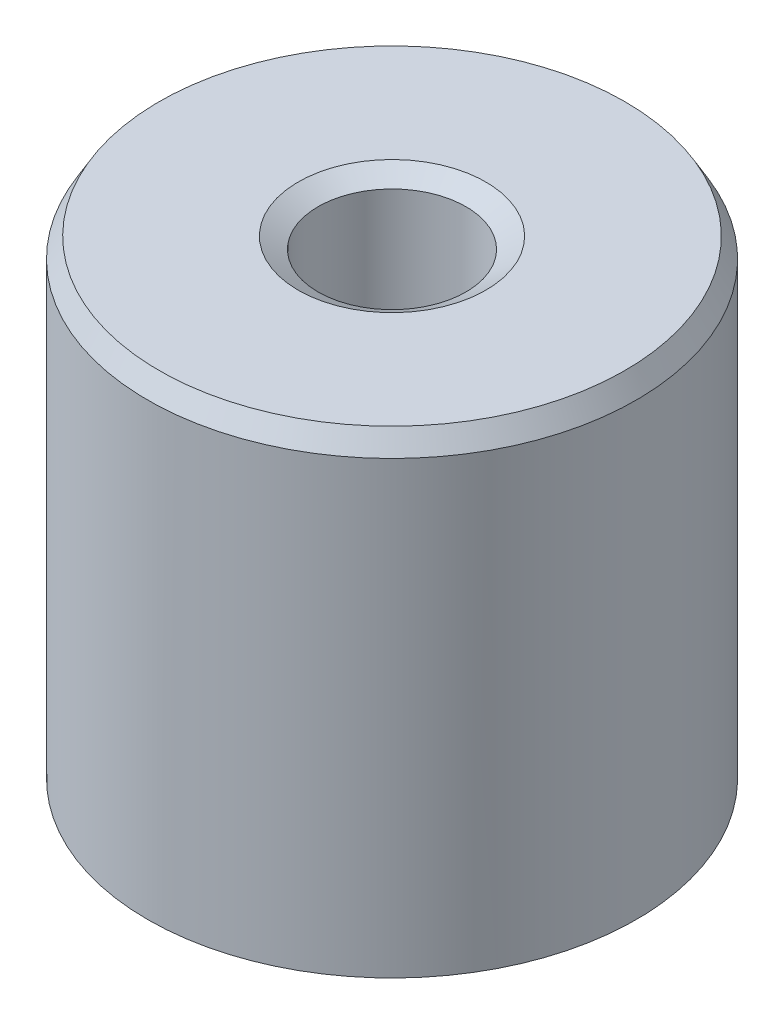
ISO-10303-21;
HEADER;
FILE_DESCRIPTION(('STEP AP214'),'2;1');
FILE_NAME('part.step','',(''),(''),'','','');
FILE_SCHEMA(('AUTOMOTIVE_DESIGN { 1 0 10303 214 1 1 1 1 }'));
ENDSEC;
DATA;
#1=APPLICATION_CONTEXT('core data for automotive mechanical design processes');
#2=APPLICATION_PROTOCOL_DEFINITION('international standard','automotive_design',2000,#1);
#3=PRODUCT_CONTEXT('',#1,'mechanical');
#4=PRODUCT('Part','Part','',(#3));
#5=PRODUCT_RELATED_PRODUCT_CATEGORY('part','',(#4));
#6=PRODUCT_DEFINITION_FORMATION('','',#4);
#7=PRODUCT_DEFINITION_CONTEXT('part definition',#1,'design');
#8=PRODUCT_DEFINITION('design','',#6,#7);
#9=PRODUCT_DEFINITION_SHAPE('','',#8);
#10=(LENGTH_UNIT() NAMED_UNIT(*) SI_UNIT(.MILLI.,.METRE.));
#11=(NAMED_UNIT(*) PLANE_ANGLE_UNIT() SI_UNIT($,.RADIAN.));
#12=(NAMED_UNIT(*) SI_UNIT($,.STERADIAN.) SOLID_ANGLE_UNIT());
#13=UNCERTAINTY_MEASURE_WITH_UNIT(LENGTH_MEASURE(1.E-05),#10,'distance_accuracy_value','');
#14=(GEOMETRIC_REPRESENTATION_CONTEXT(3) GLOBAL_UNCERTAINTY_ASSIGNED_CONTEXT((#13)) GLOBAL_UNIT_ASSIGNED_CONTEXT((#10,
#11,#12)) REPRESENTATION_CONTEXT('',''));
#15=CARTESIAN_POINT('',(0.,0.,0.));
#16=DIRECTION('',(0.,0.,1.));
#17=DIRECTION('',(1.,0.,0.));
#18=AXIS2_PLACEMENT_3D('',#15,#16,#17);
#19=CARTESIAN_POINT('',(0.,14.7705567935119,0.));
#20=DIRECTION('',(0.,-1.,0.));
#21=DIRECTION('',(0.,0.,-1.));
#22=AXIS2_PLACEMENT_3D('',#19,#20,#21);
#23=CYLINDRICAL_SURFACE('',#22,7.5);
#24=CARTESIAN_POINT('',(0.,0.351695885426955,0.));
#25=DIRECTION('',(0.,1.,0.));
#26=DIRECTION('',(0.,0.,1.));
#27=AXIS2_PLACEMENT_3D('',#24,#25,#26);
#28=CIRCLE('',#27,7.5);
#29=CARTESIAN_POINT('',(0.,0.351695885426955,7.5));
#30=VERTEX_POINT('',#29);
#31=EDGE_CURVE('E10',#30,#30,#28,.T.);
#32=ORIENTED_EDGE('',*,*,#31,.T.);
#33=EDGE_LOOP('',(#32));
#34=FACE_BOUND('',#33,.T.);
#35=CARTESIAN_POINT('',(0.,14.1614016511395,0.));
#36=DIRECTION('',(0.,1.,0.));
#37=DIRECTION('',(0.,0.,1.));
#38=AXIS2_PLACEMENT_3D('',#35,#36,#37);
#39=CIRCLE('',#38,7.5);
#40=CARTESIAN_POINT('',(0.,14.1614016511395,-7.5));
#41=VERTEX_POINT('',#40);
#42=EDGE_CURVE('E50',#41,#41,#39,.F.);
#43=ORIENTED_EDGE('',*,*,#42,.T.);
#44=EDGE_LOOP('',(#43));
#45=FACE_BOUND('',#44,.T.);
#46=ADVANCED_FACE('F39',(#34,#45),#23,.T.);
#47=CARTESIAN_POINT('',(0.,14.7705567935119,0.));
#48=DIRECTION('',(0.,1.,0.));
#49=DIRECTION('',(0.,0.,1.));
#50=AXIS2_PLACEMENT_3D('',#47,#48,#49);
#51=PLANE('',#50);
#52=CARTESIAN_POINT('',(0.,14.7705567935119,0.));
#53=DIRECTION('',(0.,1.,0.));
#54=DIRECTION('',(0.,0.,1.));
#55=AXIS2_PLACEMENT_3D('',#52,#53,#54);
#56=CIRCLE('',#55,2.87889225064983);
#57=CARTESIAN_POINT('',(0.,14.7705567935119,2.87889225064983));
#58=VERTEX_POINT('',#57);
#59=EDGE_CURVE('E58',#58,#58,#56,.F.);
#60=ORIENTED_EDGE('',*,*,#59,.T.);
#61=EDGE_LOOP('',(#60));
#62=FACE_BOUND('',#61,.T.);
#63=CARTESIAN_POINT('',(0.,14.7705567935119,0.));
#64=DIRECTION('',(0.,1.,0.));
#65=DIRECTION('',(0.,0.,1.));
#66=AXIS2_PLACEMENT_3D('',#63,#64,#65);
#67=CIRCLE('',#66,7.14830411457305);
#68=CARTESIAN_POINT('',(0.,14.7705567935119,-7.14830411457305));
#69=VERTEX_POINT('',#68);
#70=EDGE_CURVE('E61',#69,#69,#67,.T.);
#71=ORIENTED_EDGE('',*,*,#70,.T.);
#72=EDGE_LOOP('',(#71));
#73=FACE_BOUND('',#72,.T.);
#74=ADVANCED_FACE('F88',(#62,#73),#51,.T.);
#75=CARTESIAN_POINT('',(0.,0.,0.));
#76=DIRECTION('',(0.,1.,0.));
#77=DIRECTION('',(0.,0.,1.));
#78=AXIS2_PLACEMENT_3D('',#75,#76,#77);
#79=PLANE('',#78);
#80=CARTESIAN_POINT('',(0.,0.,0.));
#81=DIRECTION('',(0.,1.,0.));
#82=DIRECTION('',(0.,0.,1.));
#83=AXIS2_PLACEMENT_3D('',#80,#81,#82);
#84=CIRCLE('',#83,2.62143299370438);
#85=CARTESIAN_POINT('',(0.,0.,2.62143299370438));
#86=VERTEX_POINT('',#85);
#87=EDGE_CURVE('E51',#86,#86,#84,.T.);
#88=ORIENTED_EDGE('',*,*,#87,.T.);
#89=EDGE_LOOP('',(#88));
#90=FACE_BOUND('',#89,.T.);
#91=CARTESIAN_POINT('',(0.,0.,0.));
#92=DIRECTION('',(0.,1.,0.));
#93=DIRECTION('',(0.,0.,1.));
#94=AXIS2_PLACEMENT_3D('',#91,#92,#93);
#95=CIRCLE('',#94,6.89084485762759);
#96=CARTESIAN_POINT('',(0.,0.,6.89084485762759));
#97=VERTEX_POINT('',#96);
#98=EDGE_CURVE('E54',#97,#97,#95,.F.);
#99=ORIENTED_EDGE('',*,*,#98,.T.);
#100=EDGE_LOOP('',(#99));
#101=FACE_BOUND('',#100,.T.);
#102=ADVANCED_FACE('F83',(#90,#101),#79,.F.);
#103=CARTESIAN_POINT('',(0.,14.7705567935119,0.));
#104=DIRECTION('',(0.,-1.,0.));
#105=DIRECTION('',(0.,0.,-1.));
#106=AXIS2_PLACEMENT_3D('',#103,#104,#105);
#107=CYLINDRICAL_SURFACE('',#106,2.26973710827742);
#108=CARTESIAN_POINT('',(0.,14.418860908085,0.));
#109=DIRECTION('',(0.,1.,0.));
#110=DIRECTION('',(0.,0.,1.));
#111=AXIS2_PLACEMENT_3D('',#108,#109,#110);
#112=CIRCLE('',#111,2.26973710827742);
#113=CARTESIAN_POINT('',(0.,14.418860908085,2.26973710827742));
#114=VERTEX_POINT('',#113);
#115=EDGE_CURVE('E67',#114,#114,#112,.T.);
#116=ORIENTED_EDGE('',*,*,#115,.T.);
#117=EDGE_LOOP('',(#116));
#118=FACE_BOUND('',#117,.T.);
#119=CARTESIAN_POINT('',(0.,0.609155142372413,0.));
#120=DIRECTION('',(0.,1.,0.));
#121=DIRECTION('',(0.,0.,1.));
#122=AXIS2_PLACEMENT_3D('',#119,#120,#121);
#123=CIRCLE('',#122,2.26973710827742);
#124=CARTESIAN_POINT('',(0.,0.609155142372413,2.26973710827742));
#125=VERTEX_POINT('',#124);
#126=EDGE_CURVE('E69',#125,#125,#123,.F.);
#127=ORIENTED_EDGE('',*,*,#126,.T.);
#128=EDGE_LOOP('',(#127));
#129=FACE_BOUND('',#128,.T.);
#130=ADVANCED_FACE('F71',(#118,#129),#107,.F.);
#131=CARTESIAN_POINT('',(0.,14.418860908085,0.));
#132=DIRECTION('',(0.,1.,0.));
#133=DIRECTION('',(0.,0.,1.));
#134=AXIS2_PLACEMENT_3D('',#131,#132,#133);
#135=CONICAL_SURFACE('',#134,2.26973710827742,1.0471975511966);
#136=ORIENTED_EDGE('',*,*,#59,.F.);
#137=EDGE_LOOP('',(#136));
#138=FACE_BOUND('',#137,.T.);
#139=ORIENTED_EDGE('',*,*,#115,.F.);
#140=EDGE_LOOP('',(#139));
#141=FACE_BOUND('',#140,.T.);
#142=ADVANCED_FACE('F77',(#138,#141),#135,.F.);
#143=CARTESIAN_POINT('',(0.,0.,0.));
#144=DIRECTION('',(0.,-1.,0.));
#145=DIRECTION('',(0.,0.,-1.));
#146=AXIS2_PLACEMENT_3D('',#143,#144,#145);
#147=CONICAL_SURFACE('',#146,2.62143299370438,0.523598775598297);
#148=ORIENTED_EDGE('',*,*,#126,.F.);
#149=EDGE_LOOP('',(#148));
#150=FACE_BOUND('',#149,.T.);
#151=ORIENTED_EDGE('',*,*,#87,.F.);
#152=EDGE_LOOP('',(#151));
#153=FACE_BOUND('',#152,.T.);
#154=ADVANCED_FACE('F73',(#150,#153),#147,.F.);
#155=CARTESIAN_POINT('',(0.,0.351695885426955,0.));
#156=DIRECTION('',(0.,1.,0.));
#157=DIRECTION('',(0.,0.,1.));
#158=AXIS2_PLACEMENT_3D('',#155,#156,#157);
#159=CONICAL_SURFACE('',#158,7.5,1.0471975511966);
#160=ORIENTED_EDGE('',*,*,#98,.F.);
#161=EDGE_LOOP('',(#160));
#162=FACE_BOUND('',#161,.T.);
#163=ORIENTED_EDGE('',*,*,#31,.F.);
#164=EDGE_LOOP('',(#163));
#165=FACE_BOUND('',#164,.T.);
#166=ADVANCED_FACE('F76',(#162,#165),#159,.T.);
#167=CARTESIAN_POINT('',(0.,14.7705567935119,0.));
#168=DIRECTION('',(0.,-1.,0.));
#169=DIRECTION('',(0.,0.,-1.));
#170=AXIS2_PLACEMENT_3D('',#167,#168,#169);
#171=CONICAL_SURFACE('',#170,7.14830411457305,0.523598775598294);
#172=CARTESIAN_POINT('',(0.,14.1614016511395,-7.5));
#173=CARTESIAN_POINT('',(0.,14.1677470172059,-7.49633650119347));
#174=CARTESIAN_POINT('',(0.,14.1740923832723,-7.49267300238694));
#175=CARTESIAN_POINT('',(0.,14.186783115405,-7.48534600477388));
#176=CARTESIAN_POINT('',(0.,14.1931284814714,-7.48168250596735));
#177=CARTESIAN_POINT('',(0.,14.2058192136041,-7.47435550835428));
#178=CARTESIAN_POINT('',(0.,14.2121645796705,-7.47069200954775));
#179=CARTESIAN_POINT('',(0.,14.2248553118033,-7.46336501193469));
#180=CARTESIAN_POINT('',(0.,14.2312006778697,-7.45970151312816));
#181=CARTESIAN_POINT('',(0.,14.2438914100024,-7.4523745155151));
#182=CARTESIAN_POINT('',(0.,14.2502367760688,-7.44871101670857));
#183=CARTESIAN_POINT('',(0.,14.2629275082016,-7.44138401909551));
#184=CARTESIAN_POINT('',(0.,14.2692728742679,-7.43772052028898));
#185=CARTESIAN_POINT('',(0.,14.2819636064007,-7.43039352267592));
#186=CARTESIAN_POINT('',(0.,14.2883089724671,-7.42673002386939));
#187=CARTESIAN_POINT('',(0.,14.3009997045998,-7.41940302625632));
#188=CARTESIAN_POINT('',(0.,14.3073450706662,-7.41573952744979));
#189=CARTESIAN_POINT('',(0.,14.320035802799,-7.40841252983673));
#190=CARTESIAN_POINT('',(0.,14.3263811688654,-7.4047490310302));
#191=CARTESIAN_POINT('',(0.,14.3390719009981,-7.39742203341714));
#192=CARTESIAN_POINT('',(0.,14.3454172670645,-7.39375853461061));
#193=CARTESIAN_POINT('',(0.,14.3581079991973,-7.38643153699755));
#194=CARTESIAN_POINT('',(0.,14.3644533652636,-7.38276803819102));
#195=CARTESIAN_POINT('',(0.,14.3771440973964,-7.37544104057795));
#196=CARTESIAN_POINT('',(0.,14.3834894634628,-7.37177754177142));
#197=CARTESIAN_POINT('',(0.,14.3961801955955,-7.36445054415836));
#198=CARTESIAN_POINT('',(0.,14.4025255616619,-7.36078704535183));
#199=CARTESIAN_POINT('',(0.,14.4152162937947,-7.35346004773877));
#200=CARTESIAN_POINT('',(0.,14.421561659861,-7.34979654893224));
#201=CARTESIAN_POINT('',(0.,14.4342523919938,-7.34246955131918));
#202=CARTESIAN_POINT('',(0.,14.4405977580602,-7.33880605251265));
#203=CARTESIAN_POINT('',(0.,14.4532884901929,-7.33147905489959));
#204=CARTESIAN_POINT('',(0.,14.4596338562593,-7.32781555609306));
#205=CARTESIAN_POINT('',(0.,14.4723245883921,-7.32048855847999));
#206=CARTESIAN_POINT('',(0.,14.4786699544585,-7.31682505967346));
#207=CARTESIAN_POINT('',(0.,14.4913606865912,-7.3094980620604));
#208=CARTESIAN_POINT('',(0.,14.4977060526576,-7.30583456325387));
#209=CARTESIAN_POINT('',(0.,14.5103967847904,-7.29850756564081));
#210=CARTESIAN_POINT('',(0.,14.5167421508567,-7.29484406683428));
#211=CARTESIAN_POINT('',(0.,14.5294328829895,-7.28751706922122));
#212=CARTESIAN_POINT('',(0.,14.5357782490559,-7.28385357041469));
#213=CARTESIAN_POINT('',(0.,14.5484689811886,-7.27652657280163));
#214=CARTESIAN_POINT('',(0.,14.554814347255,-7.27286307399509));
#215=CARTESIAN_POINT('',(0.,14.5675050793878,-7.26553607638203));
#216=CARTESIAN_POINT('',(0.,14.5738504454541,-7.2618725775755));
#217=CARTESIAN_POINT('',(0.,14.5865411775869,-7.25454557996244));
#218=CARTESIAN_POINT('',(0.,14.5928865436533,-7.25088208115591));
#219=CARTESIAN_POINT('',(0.,14.605577275786,-7.24355508354285));
#220=CARTESIAN_POINT('',(0.,14.6119226418524,-7.23989158473632));
#221=CARTESIAN_POINT('',(0.,14.6246133739852,-7.23256458712326));
#222=CARTESIAN_POINT('',(0.,14.6309587400516,-7.22890108831673));
#223=CARTESIAN_POINT('',(0.,14.6436494721843,-7.22157409070366));
#224=CARTESIAN_POINT('',(0.,14.6499948382507,-7.21791059189713));
#225=CARTESIAN_POINT('',(0.,14.6626855703835,-7.21058359428407));
#226=CARTESIAN_POINT('',(0.,14.6690309364498,-7.20692009547754));
#227=CARTESIAN_POINT('',(0.,14.6817216685826,-7.19959309786448));
#228=CARTESIAN_POINT('',(0.,14.688067034649,-7.19592959905795));
#229=CARTESIAN_POINT('',(0.,14.7007577667817,-7.18860260144489));
#230=CARTESIAN_POINT('',(0.,14.7071031328481,-7.18493910263836));
#231=CARTESIAN_POINT('',(0.,14.7197938649809,-7.1776121050253));
#232=CARTESIAN_POINT('',(0.,14.7261392310472,-7.17394860621876));
#233=CARTESIAN_POINT('',(0.,14.73882996318,-7.1666216086057));
#234=CARTESIAN_POINT('',(0.,14.7451753292464,-7.16295810979917));
#235=CARTESIAN_POINT('',(0.,14.7578660613791,-7.15563111218611));
#236=CARTESIAN_POINT('',(0.,14.7642114274455,-7.15196761337958));
#237=CARTESIAN_POINT('',(0.,14.7705567935119,-7.14830411457305));
#238=B_SPLINE_CURVE_WITH_KNOTS('',3,(#172,#173,#174,#175,#176,#177,#178,#179,#180,#181,#182,
#183,#184,#185,#186,#187,#188,#189,#190,#191,#192,#193,#194,#195,#196,#197,#198,#199,#200,#201,
#202,#203,#204,#205,#206,#207,#208,#209,#210,#211,#212,#213,#214,#215,#216,#217,#218,#219,#220,
#221,#222,#223,#224,#225,#226,#227,#228,#229,#230,#231,#232,#233,#234,#235,#236,#237),
.UNSPECIFIED.,.F.,.F.,(4,2,2,2,2,2,2,2,2,2,2,2,2,2,2,2,2,2,2,2,2,2,2,2,2,2,2,2,2,2,2,2,4),(0.,
0.0219809928391837,0.0439619856783684,0.0659429785175536,0.0879239713567383,0.109904964195923,
0.131885957035107,0.153866949874291,0.175847942713477,0.197828935552661,0.219809928391846,
0.24179092123103,0.263771914070215,0.2857529069094,0.307733899748585,0.32971489258777,
0.351695885426954,0.373676878266138,0.395657871105323,0.417638863944508,0.439619856783693,
0.461600849622878,0.483581842462061,0.505562835301246,0.527543828140431,0.549524820979616,
0.571505813818801,0.593486806657984,0.615467799497169,0.637448792336354,0.659429785175539,
0.681410778014724,0.703391770853909),.UNSPECIFIED.);
#239=EDGE_CURVE('BSEAM45',#41,#69,#238,.T.);
#240=ORIENTED_EDGE('',*,*,#42,.F.);
#241=ORIENTED_EDGE('',*,*,#70,.F.);
#242=ORIENTED_EDGE('',*,*,#239,.T.);
#243=ORIENTED_EDGE('',*,*,#239,.F.);
#244=EDGE_LOOP('',(#240,#242,#241,#243));
#245=FACE_BOUND('',#244,.T.);
#246=ADVANCED_FACE('F45',(#245),#171,.T.);
#247=CLOSED_SHELL('',(#46,#74,#102,#130,#142,#154,#166,#246));
#248=MANIFOLD_SOLID_BREP('B2',#247);
#249=ADVANCED_BREP_SHAPE_REPRESENTATION('',(#18,#248),#14);
#250=SHAPE_DEFINITION_REPRESENTATION(#9,#249);
ENDSEC;
END-ISO-10303-21;
